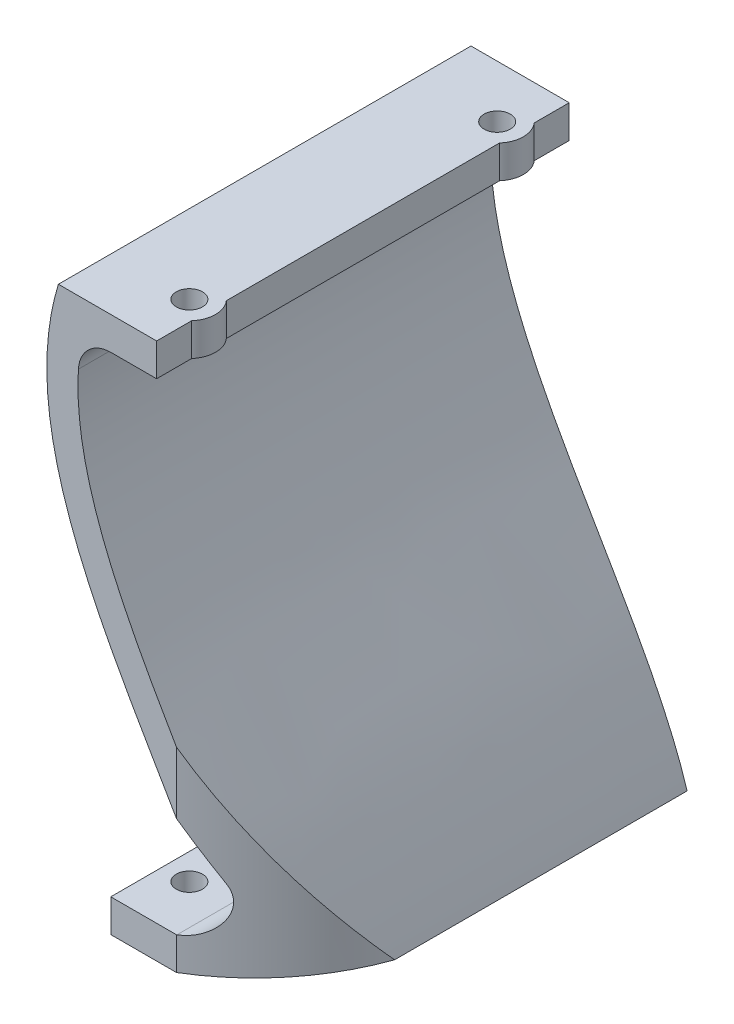
ISO-10303-21;
HEADER;
FILE_DESCRIPTION(('STEP AP214'),'2;1');
FILE_NAME('part.step','',(''),(''),'','','');
FILE_SCHEMA(('AUTOMOTIVE_DESIGN { 1 0 10303 214 1 1 1 1 }'));
ENDSEC;
DATA;
#1=APPLICATION_CONTEXT('core data for automotive mechanical design processes');
#2=APPLICATION_PROTOCOL_DEFINITION('international standard','automotive_design',2000,#1);
#3=PRODUCT_CONTEXT('',#1,'mechanical');
#4=PRODUCT('Part','Part','',(#3));
#5=PRODUCT_RELATED_PRODUCT_CATEGORY('part','',(#4));
#6=PRODUCT_DEFINITION_FORMATION('','',#4);
#7=PRODUCT_DEFINITION_CONTEXT('part definition',#1,'design');
#8=PRODUCT_DEFINITION('design','',#6,#7);
#9=PRODUCT_DEFINITION_SHAPE('','',#8);
#10=(LENGTH_UNIT() NAMED_UNIT(*) SI_UNIT(.MILLI.,.METRE.));
#11=(NAMED_UNIT(*) PLANE_ANGLE_UNIT() SI_UNIT($,.RADIAN.));
#12=(NAMED_UNIT(*) SI_UNIT($,.STERADIAN.) SOLID_ANGLE_UNIT());
#13=UNCERTAINTY_MEASURE_WITH_UNIT(LENGTH_MEASURE(1.E-05),#10,'distance_accuracy_value','');
#14=(GEOMETRIC_REPRESENTATION_CONTEXT(3) GLOBAL_UNCERTAINTY_ASSIGNED_CONTEXT((#13)) GLOBAL_UNIT_ASSIGNED_CONTEXT((#10,
#11,#12)) REPRESENTATION_CONTEXT('',''));
#15=CARTESIAN_POINT('',(0.,0.,0.));
#16=DIRECTION('',(0.,0.,1.));
#17=DIRECTION('',(1.,0.,0.));
#18=AXIS2_PLACEMENT_3D('',#15,#16,#17);
#19=CARTESIAN_POINT('',(-8.04588699669594,16.1895240178556,63.));
#20=DIRECTION('',(1.,0.,0.));
#21=DIRECTION('',(0.,0.,-1.));
#22=AXIS2_PLACEMENT_3D('',#19,#20,#21);
#23=PLANE('',#22);
#24=DIRECTION('',(0.,-1.,0.));
#25=VECTOR('',#24,1.);
#26=CARTESIAN_POINT('',(-8.04588699669594,21.1895240178556,10.6457513110646));
#27=LINE('',#26,#25);
#28=CARTESIAN_POINT('',(-8.04588699669594,21.1895240178556,10.6457513110646));
#29=VERTEX_POINT('',#28);
#30=CARTESIAN_POINT('',(-8.04588699669594,16.1895240178556,10.6457513110646));
#31=VERTEX_POINT('',#30);
#32=EDGE_CURVE('E55',#29,#31,#27,.T.);
#33=ORIENTED_EDGE('',*,*,#32,.F.);
#34=DIRECTION('',(0.,0.,-1.));
#35=VECTOR('',#34,1.);
#36=CARTESIAN_POINT('',(-8.04588699669594,21.1895240178556,63.));
#37=LINE('',#36,#35);
#38=CARTESIAN_POINT('',(-8.04588699669594,21.1895240178556,52.3542486889354));
#39=VERTEX_POINT('',#38);
#40=EDGE_CURVE('E201',#39,#29,#37,.T.);
#41=ORIENTED_EDGE('',*,*,#40,.F.);
#42=DIRECTION('',(0.,-1.,0.));
#43=VECTOR('',#42,1.);
#44=CARTESIAN_POINT('',(-8.04588699669594,21.1895240178556,52.3542486889354));
#45=LINE('',#44,#43);
#46=CARTESIAN_POINT('',(-8.04588699669594,16.1895240178556,52.3542486889354));
#47=VERTEX_POINT('',#46);
#48=EDGE_CURVE('E178',#47,#39,#45,.F.);
#49=ORIENTED_EDGE('',*,*,#48,.F.);
#50=DIRECTION('',(0.,0.,-1.));
#51=VECTOR('',#50,1.);
#52=CARTESIAN_POINT('',(-8.04588699669594,16.1895240178556,63.));
#53=LINE('',#52,#51);
#54=EDGE_CURVE('E153',#47,#31,#53,.T.);
#55=ORIENTED_EDGE('',*,*,#54,.T.);
#56=EDGE_LOOP('',(#33,#41,#49,#55));
#57=FACE_BOUND('',#56,.T.);
#58=ADVANCED_FACE('F32',(#57),#23,.T.);
#59=DIRECTION('',(0.,-1.,0.));
#60=VECTOR('',#59,1.);
#61=CARTESIAN_POINT('',(-8.04588699669594,21.1895240178556,57.6457513110646));
#62=LINE('',#61,#60);
#63=CARTESIAN_POINT('',(-8.04588699669594,21.1895240178556,57.6457513110646));
#64=VERTEX_POINT('',#63);
#65=CARTESIAN_POINT('',(-8.04588699669594,16.1895240178556,57.6457513110646));
#66=VERTEX_POINT('',#65);
#67=EDGE_CURVE('E183',#64,#66,#62,.T.);
#68=ORIENTED_EDGE('',*,*,#67,.F.);
#69=CARTESIAN_POINT('',(-8.04588699669594,21.1895240178556,63.));
#70=VERTEX_POINT('',#69);
#71=EDGE_CURVE('E154',#70,#64,#37,.T.);
#72=ORIENTED_EDGE('',*,*,#71,.F.);
#73=DIRECTION('',(0.,1.,0.));
#74=VECTOR('',#73,1.);
#75=CARTESIAN_POINT('',(-8.04588699669594,16.1895240178556,63.));
#76=LINE('',#75,#74);
#77=CARTESIAN_POINT('',(-8.04588699669594,16.1895240178556,63.));
#78=VERTEX_POINT('',#77);
#79=EDGE_CURVE('E198',#78,#70,#76,.T.);
#80=ORIENTED_EDGE('',*,*,#79,.F.);
#81=EDGE_CURVE('E156',#78,#66,#53,.T.);
#82=ORIENTED_EDGE('',*,*,#81,.T.);
#83=EDGE_LOOP('',(#68,#72,#80,#82));
#84=FACE_BOUND('',#83,.T.);
#85=ADVANCED_FACE('F390',(#84),#23,.T.);
#86=CARTESIAN_POINT('',(-22.5334776197952,22.7570781612548,63.));
#87=CARTESIAN_POINT('',(-22.8802638174594,21.7643013859488,63.));
#88=CARTESIAN_POINT('',(-23.5022218297949,19.7353540922829,63.));
#89=CARTESIAN_POINT('',(-24.3984566732412,15.7227335791878,63.));
#90=CARTESIAN_POINT('',(-24.9259424602794,10.7154717202631,63.));
#91=CARTESIAN_POINT('',(-24.7059244457818,4.80639957244901,63.));
#92=CARTESIAN_POINT('',(-23.4437954980132,-2.90791828688786,63.));
#93=CARTESIAN_POINT('',(-20.3649701079,-12.2138739410152,63.));
#94=CARTESIAN_POINT('',(-15.1627192062184,-22.9267758821705,63.));
#95=CARTESIAN_POINT('',(-9.22446854976525,-33.2839412268649,63.));
#96=CARTESIAN_POINT('',(-4.2731817504284,-41.6523064711653,63.));
#97=CARTESIAN_POINT('',(-0.670405229165687,-48.1782991582584,63.));
#98=CARTESIAN_POINT('',(1.76514247549924,-52.980809675903,63.));
#99=CARTESIAN_POINT('',(3.49961876568494,-56.8892897902748,63.));
#100=CARTESIAN_POINT('',(4.67496429136453,-59.9655632013083,63.));
#101=CARTESIAN_POINT('',(5.17847746688474,-61.4613851443489,63.));
#102=CARTESIAN_POINT('',(5.41540171981831,-62.2227851308582,63.));
#103=B_SPLINE_CURVE_WITH_KNOTS('',3,(#86,#87,#88,#89,#90,#91,#92,#93,#94,#95,#96,#97,#98,#99,
#100,#101,#102),.UNSPECIFIED.,.F.,.F.,(4,1,1,1,1,1,1,1,1,1,1,1,1,1,4),(0.,0.03125,0.0625,0.125,
0.1875,0.25,0.375,0.5,0.625,0.75,0.8125,0.875,0.9375,0.96875,1.),.UNSPECIFIED.);
#104=DIRECTION('',(0.,0.,-1.));
#105=VECTOR('',#104,1.);
#106=SURFACE_OF_LINEAR_EXTRUSION('',#103,#105);
#107=CARTESIAN_POINT('',(-22.5334776197952,22.7570781612548,0.));
#108=CARTESIAN_POINT('',(-22.8802638174594,21.7643013859488,0.));
#109=CARTESIAN_POINT('',(-23.5022218297949,19.7353540922829,0.));
#110=CARTESIAN_POINT('',(-24.3984566732412,15.7227335791878,0.));
#111=CARTESIAN_POINT('',(-24.9259424602794,10.7154717202631,0.));
#112=CARTESIAN_POINT('',(-24.7059244457818,4.80639957244901,0.));
#113=CARTESIAN_POINT('',(-23.4437954980132,-2.90791828688786,0.));
#114=CARTESIAN_POINT('',(-20.3649701079,-12.2138739410152,0.));
#115=CARTESIAN_POINT('',(-15.1627192062184,-22.9267758821705,0.));
#116=CARTESIAN_POINT('',(-9.22446854976525,-33.2839412268649,0.));
#117=CARTESIAN_POINT('',(-4.2731817504284,-41.6523064711653,0.));
#118=CARTESIAN_POINT('',(-0.670405229165687,-48.1782991582584,0.));
#119=CARTESIAN_POINT('',(1.76514247549924,-52.980809675903,0.));
#120=CARTESIAN_POINT('',(3.49961876568494,-56.8892897902748,0.));
#121=CARTESIAN_POINT('',(4.67496429136453,-59.9655632013083,0.));
#122=CARTESIAN_POINT('',(5.17847746688474,-61.4613851443489,0.));
#123=CARTESIAN_POINT('',(5.41540171981831,-62.2227851308582,0.));
#124=B_SPLINE_CURVE_WITH_KNOTS('',3,(#107,#108,#109,#110,#111,#112,#113,#114,#115,#116,#117,
#118,#119,#120,#121,#122,#123),.UNSPECIFIED.,.F.,.F.,(4,1,1,1,1,1,1,1,1,1,1,1,1,1,4),(0.,
0.03125,0.0625,0.125,0.1875,0.25,0.375,0.5,0.625,0.75,0.8125,0.875,0.9375,0.96875,1.),.UNSPECIFIED.);
#125=CARTESIAN_POINT('',(-23.0458869966959,21.1895240178556,0.));
#126=VERTEX_POINT('',#125);
#127=CARTESIAN_POINT('',(-0.547367076397604,-48.4799277852592,0.));
#128=VERTEX_POINT('',#127);
#129=EDGE_CURVE('E321',#126,#128,#124,.T.);
#130=ORIENTED_EDGE('',*,*,#129,.T.);
#131=DIRECTION('',(0.,0.,-1.));
#132=VECTOR('',#131,1.);
#133=CARTESIAN_POINT('',(-0.547367076397604,-48.4799277852592,0.));
#134=LINE('',#133,#132);
#135=CARTESIAN_POINT('',(-0.547367076397604,-48.4799277852592,59.8107553305762));
#136=VERTEX_POINT('',#135);
#137=EDGE_CURVE('E345',#128,#136,#134,.F.);
#138=ORIENTED_EDGE('',*,*,#137,.T.);
#139=CARTESIAN_POINT('',(4.95411300330391,-60.8104759821441,54.0000000000008));
#140=CARTESIAN_POINT('',(4.90349240523971,-60.6624313935854,54.0674948355469));
#141=CARTESIAN_POINT('',(4.85228015714574,-60.5147179013902,54.1352686678515));
#142=CARTESIAN_POINT('',(4.74872079575584,-60.2199020777657,54.2712735017647));
#143=CARTESIAN_POINT('',(4.69637369264215,-60.0727997408671,54.3395044992676));
#144=CARTESIAN_POINT('',(4.53770600661707,-59.6323418051575,54.5447278378918));
#145=CARTESIAN_POINT('',(4.42975460412531,-59.3398223214441,54.6822564553985));
#146=CARTESIAN_POINT('',(4.2099997972146,-58.7573547873543,54.9578604064212));
#147=CARTESIAN_POINT('',(4.09820516931407,-58.4674025618739,55.0959339299031));
#148=CARTESIAN_POINT('',(3.87072927247109,-57.8892159839013,55.372479618315));
#149=CARTESIAN_POINT('',(3.75504796123735,-57.6009816501418,55.5109517875676));
#150=CARTESIAN_POINT('',(3.40277730186655,-56.7393967928728,55.9259585911872));
#151=CARTESIAN_POINT('',(3.16063667503191,-56.1683081741342,56.2024916641073));
#152=CARTESIAN_POINT('',(2.66323588313109,-55.0311603375767,56.752440378181));
#153=CARTESIAN_POINT('',(2.40798853220512,-54.4650968189405,57.0258587564976));
#154=CARTESIAN_POINT('',(1.88556069418228,-53.3365016649056,57.567548245747));
#155=CARTESIAN_POINT('',(1.61838726458699,-52.7739681595952,57.8358222700236));
#156=CARTESIAN_POINT('',(1.073194276384,-51.6511984601395,58.3656141915534));
#157=CARTESIAN_POINT('',(0.79517759037044,-51.0909617004231,58.6271338480642));
#158=CARTESIAN_POINT('',(0.229354253579259,-49.971891846354,59.1421014589343));
#159=CARTESIAN_POINT('',(-0.0584503905774647,-49.4130584892179,59.3955510473469));
#160=CARTESIAN_POINT('',(-0.643021472242761,-48.2958111208271,59.8934766461389));
#161=CARTESIAN_POINT('',(-0.939790828653196,-47.7373973081717,60.1379496750854));
#162=CARTESIAN_POINT('',(-1.54143204723711,-46.620198752619,60.6171398718671));
#163=CARTESIAN_POINT('',(-1.84630918952724,-46.0614140111213,60.8518504136079));
#164=CARTESIAN_POINT('',(-2.46331872475682,-44.9427496650343,61.3108798373551));
#165=CARTESIAN_POINT('',(-2.77545814129195,-44.3828695246849,61.5351879732312));
#166=CARTESIAN_POINT('',(-3.40618824346694,-43.2613700453329,61.9729133196452));
#167=CARTESIAN_POINT('',(-3.72478710707736,-42.6997493772916,62.1863153414548));
#168=CARTESIAN_POINT('',(-4.36760769727572,-41.5741550070399,62.6018397814107));
#169=CARTESIAN_POINT('',(-4.6918380749877,-41.0101789264886,62.803942373091));
#170=CARTESIAN_POINT('',(-5.01813061937269,-40.4452947255246,63.));
#171=B_SPLINE_CURVE_WITH_KNOTS('',3,(#139,#140,#141,#142,#143,#144,#145,#146,#147,#148,#149,
#150,#151,#152,#153,#154,#155,#156,#157,#158,#159,#160,#161,#162,#163,#164,#165,#166,#167,#168,
#169,#170),.UNSPECIFIED.,.F.,.F.,(4,2,2,2,2,2,2,2,2,2,2,2,2,2,2,4),(0.,0.51118765682345,
1.0223707290117,2.04469209211411,3.0648164806874,4.08495197290759,6.12221617166067,
8.15752516266589,10.1916452842124,12.2252301392514,14.2584005745832,16.2922402994086,
18.3274386472271,20.3646946291989,22.4047145812519,24.4482084138024),.UNSPECIFIED.);
#172=CARTESIAN_POINT('',(-5.01813061937269,-40.4452947344386,63.));
#173=VERTEX_POINT('',#172);
#174=EDGE_CURVE('E234',#136,#173,#171,.T.);
#175=ORIENTED_EDGE('',*,*,#174,.T.);
#176=CARTESIAN_POINT('',(-23.0458869966959,21.1895240178556,63.));
#177=VERTEX_POINT('',#176);
#178=EDGE_CURVE('E303',#177,#173,#103,.T.);
#179=ORIENTED_EDGE('',*,*,#178,.F.);
#180=DIRECTION('',(0.,0.,-1.));
#181=VECTOR('',#180,1.);
#182=CARTESIAN_POINT('',(-23.0458869966959,21.1895240178556,63.));
#183=LINE('',#182,#181);
#184=EDGE_CURVE('E333',#177,#126,#183,.T.);
#185=ORIENTED_EDGE('',*,*,#184,.T.);
#186=EDGE_LOOP('',(#130,#138,#175,#179,#185));
#187=FACE_BOUND('',#186,.T.);
#188=ADVANCED_FACE('F250',(#187),#106,.F.);
#189=CARTESIAN_POINT('',(9.95411300330407,-60.8104759821444,63.));
#190=CARTESIAN_POINT('',(1.78782004145555,-34.5665002552168,63.));
#191=CARTESIAN_POINT('',(-27.9913048539535,-7.28206006884536,63.));
#192=CARTESIAN_POINT('',(-18.0458869966959,21.1895240178556,63.));
#193=B_SPLINE_CURVE_WITH_KNOTS('',3,(#189,#190,#191,#192),.UNSPECIFIED.,.F.,.F.,(4,4),(0.,1.),.UNSPECIFIED.);
#194=DIRECTION('',(0.,0.,-1.));
#195=VECTOR('',#194,1.);
#196=SURFACE_OF_LINEAR_EXTRUSION('',#193,#195);
#197=CARTESIAN_POINT('',(9.95411300330407,-60.8104759821444,0.));
#198=CARTESIAN_POINT('',(1.78782004145555,-34.5665002552168,0.));
#199=CARTESIAN_POINT('',(-27.9913048539535,-7.28206006884536,0.));
#200=CARTESIAN_POINT('',(-18.0458869966959,21.1895240178556,0.));
#201=B_SPLINE_CURVE_WITH_KNOTS('',3,(#197,#198,#199,#200),.UNSPECIFIED.,.F.,.F.,(4,4),(0.,1.),.UNSPECIFIED.);
#202=CARTESIAN_POINT('',(9.95411300330406,-60.8104759821444,0.));
#203=VERTEX_POINT('',#202);
#204=CARTESIAN_POINT('',(-19.9900394366485,11.486126685123,0.));
#205=VERTEX_POINT('',#204);
#206=EDGE_CURVE('E280',#203,#205,#201,.T.);
#207=ORIENTED_EDGE('',*,*,#206,.T.);
#208=DIRECTION('',(0.,0.,-1.));
#209=VECTOR('',#208,1.);
#210=CARTESIAN_POINT('',(-19.9900394366485,11.486126685123,0.));
#211=LINE('',#210,#209);
#212=CARTESIAN_POINT('',(-19.9900394366485,11.486126685123,63.));
#213=VERTEX_POINT('',#212);
#214=EDGE_CURVE('E277',#205,#213,#211,.F.);
#215=ORIENTED_EDGE('',*,*,#214,.T.);
#216=CARTESIAN_POINT('',(-5.01813061937411,-31.0078311625551,63.));
#217=VERTEX_POINT('',#216);
#218=EDGE_CURVE('E292',#217,#213,#193,.T.);
#219=ORIENTED_EDGE('',*,*,#218,.F.);
#220=CARTESIAN_POINT('',(-5.0181306193727,-31.0078311625575,63.));
#221=CARTESIAN_POINT('',(-4.60935478871972,-31.7093489817674,62.7543834576857));
#222=CARTESIAN_POINT('',(-4.20131738668795,-32.4074621662793,62.4977858251789));
#223=CARTESIAN_POINT('',(-3.38815053326057,-33.7979902999724,61.9622212423446));
#224=CARTESIAN_POINT('',(-2.98302506777499,-34.4903975790361,61.6832283301339));
#225=CARTESIAN_POINT('',(-2.17774614790639,-35.8695543054951,61.1027999865766));
#226=CARTESIAN_POINT('',(-1.77759715288152,-36.5562985153545,60.8013459119863));
#227=CARTESIAN_POINT('',(-0.984236379295756,-37.9241689025045,60.176069993751));
#228=CARTESIAN_POINT('',(-0.591028520440266,-38.6052917966567,59.8522359892382));
#229=CARTESIAN_POINT('',(0.186556274459307,-39.9619679869169,59.1823796789401));
#230=CARTESIAN_POINT('',(0.570930531293133,-40.6375195544411,58.8363507590432));
#231=CARTESIAN_POINT('',(1.3290305770706,-41.9831065709882,58.1223910025535));
#232=CARTESIAN_POINT('',(1.70275537964647,-42.6531415049921,57.7544581468735));
#233=CARTESIAN_POINT('',(2.43012663076156,-43.9738009345563,57.0049927504614));
#234=CARTESIAN_POINT('',(2.78402981414216,-44.6245377583915,56.6239074134592));
#235=CARTESIAN_POINT('',(3.47834929596888,-45.9207760458694,55.841592183967));
#236=CARTESIAN_POINT('',(3.8187694469618,-46.5662789624713,55.4403681211582));
#237=CARTESIAN_POINT('',(4.48461305361077,-47.8521060489027,54.6183080963177));
#238=CARTESIAN_POINT('',(4.81004218024758,-48.4924321002493,54.1974796736569));
#239=CARTESIAN_POINT('',(5.44446074986746,-49.7679759540932,53.3368082931973));
#240=CARTESIAN_POINT('',(5.75345713100086,-50.4031958147794,52.8969735046521));
#241=CARTESIAN_POINT('',(6.35362692502806,-51.668602208051,51.998950726406));
#242=CARTESIAN_POINT('',(6.64480781639683,-52.2987907547047,51.5407705731015));
#243=CARTESIAN_POINT('',(7.20802833998733,-53.5542360752454,50.6067565075788));
#244=CARTESIAN_POINT('',(7.48007509549706,-54.1794946066895,50.1309292668871));
#245=CARTESIAN_POINT('',(7.88360437077701,-55.1393628105839,49.3846055812668));
#246=CARTESIAN_POINT('',(8.02228760728581,-55.4756419508452,49.1201168128509));
#247=CARTESIAN_POINT('',(8.29348824945376,-56.1468062732093,48.5863134766866));
#248=CARTESIAN_POINT('',(8.42600620315316,-56.4816915767931,48.3169993408307));
#249=CARTESIAN_POINT('',(8.68468158126303,-57.1500766823737,47.7736773751326));
#250=CARTESIAN_POINT('',(8.81083932781482,-57.4835765537551,47.4996697839553));
#251=CARTESIAN_POINT('',(9.05731909261769,-58.1511351652741,46.9454888321691));
#252=CARTESIAN_POINT('',(9.17760304580604,-58.4851859397498,46.6652889384022));
#253=CARTESIAN_POINT('',(9.41135731410957,-59.1519111697765,46.1004093247949));
#254=CARTESIAN_POINT('',(9.52482730060768,-59.4845855582292,45.8157293897299));
#255=CARTESIAN_POINT('',(9.7447698306712,-60.1485677299589,45.2420271879806));
#256=CARTESIAN_POINT('',(9.85124160344067,-60.4798753589445,44.9530044472646));
#257=CARTESIAN_POINT('',(9.95411300330407,-60.8104759821444,44.6619037896883));
#258=B_SPLINE_CURVE_WITH_KNOTS('',3,(#220,#221,#222,#223,#224,#225,#226,#227,#228,#229,#230,
#231,#232,#233,#234,#235,#236,#237,#238,#239,#240,#241,#242,#243,#244,#245,#246,#247,#248,#249,
#250,#251,#252,#253,#254,#255,#256,#257),.UNSPECIFIED.,.F.,.F.,(4,2,2,2,2,2,2,2,2,2,2,2,2,2,2,2,
2,2,4),(0.,2.5447278282158,5.09244947623089,7.64230986377158,10.1935668641723,12.7455877066058,
15.2978441576055,17.796560169186,20.2945569873373,22.7916009405601,25.2875820950726,
27.7825082102457,30.276500539272,31.625677636978,32.9747345744782,34.3237231141295,
35.6805309618773,37.0374041919111,38.394426620853),.UNSPECIFIED.);
#259=CARTESIAN_POINT('',(9.95411300330406,-60.8104759821444,44.6619037896883));
#260=VERTEX_POINT('',#259);
#261=EDGE_CURVE('E242',#217,#260,#258,.T.);
#262=ORIENTED_EDGE('',*,*,#261,.T.);
#263=DIRECTION('',(0.,0.,-1.));
#264=VECTOR('',#263,1.);
#265=CARTESIAN_POINT('',(9.95411300330406,-60.8104759821444,63.));
#266=LINE('',#265,#264);
#267=EDGE_CURVE('E308',#260,#203,#266,.T.);
#268=ORIENTED_EDGE('',*,*,#267,.T.);
#269=EDGE_LOOP('',(#207,#215,#219,#262,#268));
#270=FACE_BOUND('',#269,.T.);
#271=ADVANCED_FACE('F287',(#270),#196,.F.);
#272=CARTESIAN_POINT('',(-18.0458869966959,21.1895240178556,63.));
#273=DIRECTION('',(0.,-1.,0.));
#274=DIRECTION('',(0.,0.,-1.));
#275=AXIS2_PLACEMENT_3D('',#272,#273,#274);
#276=PLANE('',#275);
#277=ORIENTED_EDGE('',*,*,#40,.T.);
#278=CARTESIAN_POINT('',(-11.0458869966959,21.1895240178556,8.));
#279=DIRECTION('',(0.,-1.,0.));
#280=DIRECTION('',(1.,0.,0.));
#281=AXIS2_PLACEMENT_3D('',#278,#279,#280);
#282=CIRCLE('',#281,4.);
#283=CARTESIAN_POINT('',(-8.04588699669594,21.1895240178556,5.35424868893539));
#284=VERTEX_POINT('',#283);
#285=EDGE_CURVE('E162',#284,#29,#282,.T.);
#286=ORIENTED_EDGE('',*,*,#285,.F.);
#287=CARTESIAN_POINT('',(-8.04588699669594,21.1895240178556,0.));
#288=VERTEX_POINT('',#287);
#289=EDGE_CURVE('E47',#284,#288,#37,.T.);
#290=ORIENTED_EDGE('',*,*,#289,.T.);
#291=DIRECTION('',(-1.,0.,0.));
#292=VECTOR('',#291,1.);
#293=CARTESIAN_POINT('',(-18.0458869966959,21.1895240178556,0.));
#294=LINE('',#293,#292);
#295=EDGE_CURVE('E316',#288,#126,#294,.T.);
#296=ORIENTED_EDGE('',*,*,#295,.T.);
#297=ORIENTED_EDGE('',*,*,#184,.F.);
#298=DIRECTION('',(-1.,0.,0.));
#299=VECTOR('',#298,1.);
#300=CARTESIAN_POINT('',(-18.0458869966959,21.1895240178556,63.));
#301=LINE('',#300,#299);
#302=EDGE_CURVE('E298',#70,#177,#301,.T.);
#303=ORIENTED_EDGE('',*,*,#302,.F.);
#304=ORIENTED_EDGE('',*,*,#71,.T.);
#305=CARTESIAN_POINT('',(-11.0458869966959,21.1895240178556,55.));
#306=DIRECTION('',(0.,-1.,0.));
#307=DIRECTION('',(1.,0.,0.));
#308=AXIS2_PLACEMENT_3D('',#305,#306,#307);
#309=CIRCLE('',#308,4.);
#310=EDGE_CURVE('E175',#39,#64,#309,.T.);
#311=ORIENTED_EDGE('',*,*,#310,.F.);
#312=EDGE_LOOP('',(#277,#286,#290,#296,#297,#303,#304,#311));
#313=FACE_BOUND('',#312,.T.);
#314=CARTESIAN_POINT('',(-11.0458869966959,21.1895240178556,55.));
#315=DIRECTION('',(0.,-1.,0.));
#316=DIRECTION('',(0.,0.,-1.));
#317=AXIS2_PLACEMENT_3D('',#314,#315,#316);
#318=CIRCLE('',#317,2.);
#319=CARTESIAN_POINT('',(-11.0458869966959,21.1895240178556,53.));
#320=VERTEX_POINT('',#319);
#321=EDGE_CURVE('E190',#320,#320,#318,.T.);
#322=ORIENTED_EDGE('',*,*,#321,.T.);
#323=EDGE_LOOP('',(#322));
#324=FACE_BOUND('',#323,.T.);
#325=CARTESIAN_POINT('',(-11.0458869966959,21.1895240178556,8.));
#326=DIRECTION('',(0.,-1.,0.));
#327=DIRECTION('',(0.,0.,-1.));
#328=AXIS2_PLACEMENT_3D('',#325,#326,#327);
#329=CIRCLE('',#328,2.);
#330=CARTESIAN_POINT('',(-11.0458869966959,21.1895240178556,6.));
#331=VERTEX_POINT('',#330);
#332=EDGE_CURVE('E195',#331,#331,#329,.T.);
#333=ORIENTED_EDGE('',*,*,#332,.T.);
#334=EDGE_LOOP('',(#333));
#335=FACE_BOUND('',#334,.T.);
#336=ADVANCED_FACE('F290',(#313,#324,#335),#276,.F.);
#337=CARTESIAN_POINT('',(9.95411300330406,-60.8104759821444,63.));
#338=DIRECTION('',(0.,1.,0.));
#339=DIRECTION('',(0.,0.,1.));
#340=AXIS2_PLACEMENT_3D('',#337,#338,#339);
#341=PLANE('',#340);
#342=CARTESIAN_POINT('',(-11.0458869966959,-60.8104759821444,55.));
#343=DIRECTION('',(0.,1.,0.));
#344=DIRECTION('',(0.,0.,1.));
#345=AXIS2_PLACEMENT_3D('',#342,#343,#344);
#346=CIRCLE('',#345,2.);
#347=CARTESIAN_POINT('',(-11.0458869966959,-60.8104759821444,57.));
#348=VERTEX_POINT('',#347);
#349=EDGE_CURVE('E165',#348,#348,#346,.T.);
#350=ORIENTED_EDGE('',*,*,#349,.T.);
#351=EDGE_LOOP('',(#350));
#352=FACE_BOUND('',#351,.T.);
#353=CARTESIAN_POINT('',(-11.0458869966959,-60.8104759821444,8.));
#354=DIRECTION('',(0.,1.,0.));
#355=DIRECTION('',(0.,0.,1.));
#356=AXIS2_PLACEMENT_3D('',#353,#354,#355);
#357=CIRCLE('',#356,2.);
#358=CARTESIAN_POINT('',(-11.0458869966959,-60.8104759821444,10.));
#359=VERTEX_POINT('',#358);
#360=EDGE_CURVE('E571',#359,#359,#357,.T.);
#361=ORIENTED_EDGE('',*,*,#360,.T.);
#362=EDGE_LOOP('',(#361));
#363=FACE_BOUND('',#362,.T.);
#364=ORIENTED_EDGE('',*,*,#267,.F.);
#365=CARTESIAN_POINT('',(-23.0458869966979,-60.8104759821444,33.0000000000031));
#366=DIRECTION('',(0.,1.,0.));
#367=DIRECTION('',(0.,0.,-1.));
#368=AXIS2_PLACEMENT_3D('',#365,#366,#367);
#369=CIRCLE('',#368,35.);
#370=CARTESIAN_POINT('',(-5.01813061937269,-60.8104759821444,63.));
#371=VERTEX_POINT('',#370);
#372=EDGE_CURVE('E229',#371,#260,#369,.T.);
#373=ORIENTED_EDGE('',*,*,#372,.F.);
#374=DIRECTION('',(-1.,0.,0.));
#375=VECTOR('',#374,1.);
#376=CARTESIAN_POINT('',(-5.01813061937269,-60.8104759821444,63.));
#377=LINE('',#376,#375);
#378=CARTESIAN_POINT('',(-15.0458869966959,-60.8104759821444,63.));
#379=VERTEX_POINT('',#378);
#380=EDGE_CURVE('E221',#371,#379,#377,.T.);
#381=ORIENTED_EDGE('',*,*,#380,.T.);
#382=DIRECTION('',(0.,0.,-1.));
#383=VECTOR('',#382,1.);
#384=CARTESIAN_POINT('',(-15.0458869966959,-60.8104759821444,0.));
#385=LINE('',#384,#383);
#386=CARTESIAN_POINT('',(-15.0458869966959,-60.8104759821444,0.));
#387=VERTEX_POINT('',#386);
#388=EDGE_CURVE('E211',#379,#387,#385,.T.);
#389=ORIENTED_EDGE('',*,*,#388,.T.);
#390=DIRECTION('',(1.,0.,0.));
#391=VECTOR('',#390,1.);
#392=CARTESIAN_POINT('',(9.95411300330406,-60.8104759821444,0.));
#393=LINE('',#392,#391);
#394=EDGE_CURVE('E299',#387,#203,#393,.T.);
#395=ORIENTED_EDGE('',*,*,#394,.T.);
#396=EDGE_LOOP('',(#364,#373,#381,#389,#395));
#397=FACE_BOUND('',#396,.T.);
#398=ADVANCED_FACE('F373',(#352,#363,#397),#341,.F.);
#399=CARTESIAN_POINT('',(-10.8377785538607,-20.6458291170594,63.));
#400=DIRECTION('',(0.,0.,-1.));
#401=DIRECTION('',(-1.,0.,0.));
#402=AXIS2_PLACEMENT_3D('',#399,#400,#401);
#403=PLANE('',#402);
#404=ORIENTED_EDGE('',*,*,#178,.T.);
#405=DIRECTION('',(0.,-1.,0.));
#406=VECTOR('',#405,1.);
#407=CARTESIAN_POINT('',(-5.0181306193727,-0.81047598214444,63.));
#408=LINE('',#407,#406);
#409=EDGE_CURVE('E337',#173,#217,#408,.F.);
#410=ORIENTED_EDGE('',*,*,#409,.T.);
#411=ORIENTED_EDGE('',*,*,#218,.T.);
#412=CARTESIAN_POINT('',(-14.9988445037922,11.1895240178556,63.));
#413=DIRECTION('',(0.,0.,-1.));
#414=DIRECTION('',(-1.,0.,0.));
#415=AXIS2_PLACEMENT_3D('',#412,#413,#414);
#416=CIRCLE('',#415,5.);
#417=CARTESIAN_POINT('',(-14.9988445037922,16.1895240178556,63.));
#418=VERTEX_POINT('',#417);
#419=EDGE_CURVE('E40',#213,#418,#416,.T.);
#420=ORIENTED_EDGE('',*,*,#419,.T.);
#421=DIRECTION('',(1.,0.,0.));
#422=VECTOR('',#421,1.);
#423=CARTESIAN_POINT('',(-18.0458869966959,16.1895240178556,63.));
#424=LINE('',#423,#422);
#425=EDGE_CURVE('E204',#418,#78,#424,.T.);
#426=ORIENTED_EDGE('',*,*,#425,.T.);
#427=ORIENTED_EDGE('',*,*,#79,.T.);
#428=ORIENTED_EDGE('',*,*,#302,.T.);
#429=EDGE_LOOP('',(#404,#410,#411,#420,#426,#427,#428));
#430=FACE_BOUND('',#429,.T.);
#431=ADVANCED_FACE('F265',(#430),#403,.F.);
#432=CARTESIAN_POINT('',(-10.8377785538607,-20.6458291170594,0.));
#433=DIRECTION('',(0.,0.,-1.));
#434=DIRECTION('',(-1.,0.,0.));
#435=AXIS2_PLACEMENT_3D('',#432,#433,#434);
#436=PLANE('',#435);
#437=ORIENTED_EDGE('',*,*,#394,.F.);
#438=DIRECTION('',(0.,-1.,0.));
#439=VECTOR('',#438,1.);
#440=CARTESIAN_POINT('',(-15.0458869966959,-55.8104759821444,0.));
#441=LINE('',#440,#439);
#442=CARTESIAN_POINT('',(-15.0458869966959,-55.8104759821444,0.));
#443=VERTEX_POINT('',#442);
#444=EDGE_CURVE('E226',#443,#387,#441,.T.);
#445=ORIENTED_EDGE('',*,*,#444,.F.);
#446=DIRECTION('',(1.,0.,0.));
#447=VECTOR('',#446,1.);
#448=CARTESIAN_POINT('',(-15.0458869966959,-55.8104759821444,0.));
#449=LINE('',#448,#447);
#450=CARTESIAN_POINT('',(-4.97100190558444,-55.8104759821444,0.));
#451=VERTEX_POINT('',#450);
#452=EDGE_CURVE('E217',#443,#451,#449,.T.);
#453=ORIENTED_EDGE('',*,*,#452,.T.);
#454=CARTESIAN_POINT('',(-4.97100190558444,-50.8104759821445,0.));
#455=DIRECTION('',(0.,0.,-1.));
#456=DIRECTION('',(-1.,0.,0.));
#457=AXIS2_PLACEMENT_3D('',#454,#455,#456);
#458=CIRCLE('',#457,5.);
#459=EDGE_CURVE('E278',#451,#128,#458,.F.);
#460=ORIENTED_EDGE('',*,*,#459,.T.);
#461=ORIENTED_EDGE('',*,*,#129,.F.);
#462=ORIENTED_EDGE('',*,*,#295,.F.);
#463=DIRECTION('',(0.,1.,0.));
#464=VECTOR('',#463,1.);
#465=CARTESIAN_POINT('',(-8.04588699669594,16.1895240178556,0.));
#466=LINE('',#465,#464);
#467=CARTESIAN_POINT('',(-8.04588699669594,16.1895240178556,0.));
#468=VERTEX_POINT('',#467);
#469=EDGE_CURVE('E202',#468,#288,#466,.T.);
#470=ORIENTED_EDGE('',*,*,#469,.F.);
#471=DIRECTION('',(1.,0.,0.));
#472=VECTOR('',#471,1.);
#473=CARTESIAN_POINT('',(-18.0458869966959,16.1895240178556,0.));
#474=LINE('',#473,#472);
#475=CARTESIAN_POINT('',(-14.9988445037922,16.1895240178556,0.));
#476=VERTEX_POINT('',#475);
#477=EDGE_CURVE('E151',#476,#468,#474,.T.);
#478=ORIENTED_EDGE('',*,*,#477,.F.);
#479=CARTESIAN_POINT('',(-14.9988445037922,11.1895240178556,0.));
#480=DIRECTION('',(0.,0.,-1.));
#481=DIRECTION('',(-1.,0.,0.));
#482=AXIS2_PLACEMENT_3D('',#479,#480,#481);
#483=CIRCLE('',#482,5.);
#484=EDGE_CURVE('E11',#476,#205,#483,.F.);
#485=ORIENTED_EDGE('',*,*,#484,.T.);
#486=ORIENTED_EDGE('',*,*,#206,.F.);
#487=EDGE_LOOP('',(#437,#445,#453,#460,#461,#462,#470,#478,#485,#486));
#488=FACE_BOUND('',#487,.T.);
#489=ADVANCED_FACE('F261',(#488),#436,.T.);
#490=CARTESIAN_POINT('',(-23.0458869966979,-0.81047598214444,33.0000000000031));
#491=DIRECTION('',(0.,-1.,0.));
#492=DIRECTION('',(0.,0.,-1.));
#493=AXIS2_PLACEMENT_3D('',#490,#491,#492);
#494=CYLINDRICAL_SURFACE('',#493,35.);
#495=ORIENTED_EDGE('',*,*,#174,.F.);
#496=CARTESIAN_POINT('',(-0.547367076397604,-48.4799277852592,59.8107553305762));
#497=CARTESIAN_POINT('',(-0.497352203450341,-48.5748468475239,59.7687849611889));
#498=CARTESIAN_POINT('',(-0.450019764998988,-48.6721128439989,59.7288266569617));
#499=CARTESIAN_POINT('',(-0.361168492256912,-48.8710692269845,59.6534602501073));
#500=CARTESIAN_POINT('',(-0.319654517811251,-48.9727632201404,59.6180559531997));
#501=CARTESIAN_POINT('',(-0.242818447225023,-49.1805668908898,59.5522623449912));
#502=CARTESIAN_POINT('',(-0.207522084906531,-49.2866927706424,59.5218939054326));
#503=CARTESIAN_POINT('',(-0.14382381436109,-49.5024257205868,59.4669090416992));
#504=CARTESIAN_POINT('',(-0.115420130789087,-49.6120318861198,59.4422911364225));
#505=CARTESIAN_POINT('',(-0.0658086346219534,-49.8346912834593,59.3991872392885));
#506=CARTESIAN_POINT('',(-0.0446400195729425,-49.9477597854684,59.3807346611385));
#507=CARTESIAN_POINT('',(-0.0100835349486135,-50.1759650327343,59.3505652176071));
#508=CARTESIAN_POINT('',(0.00330495077993898,-50.2911016134632,59.3388478188289));
#509=CARTESIAN_POINT('',(0.0220263081494884,-50.5222417277358,59.3224529924965));
#510=CARTESIAN_POINT('',(0.0273790214721301,-50.6382424127962,59.3177582249814));
#511=CARTESIAN_POINT('',(0.0299864462437955,-50.8703973771393,59.3154720293513));
#512=CARTESIAN_POINT('',(0.0272417972542282,-50.9865516435673,59.3178800402309));
#513=CARTESIAN_POINT('',(0.014212274575819,-51.2094162834473,59.3292971767019));
#514=CARTESIAN_POINT('',(0.00450321260185671,-51.3161866951164,59.3378021772774));
#515=CARTESIAN_POINT('',(-0.0216385549246912,-51.5282790162719,59.3606576974807));
#516=CARTESIAN_POINT('',(-0.0380734494454068,-51.6336004426306,59.3750101201851));
#517=CARTESIAN_POINT('',(-0.0971422077593378,-51.9464481650583,59.4264624477316));
#518=CARTESIAN_POINT('',(-0.14954077910925,-52.1508681925408,59.4719579771349));
#519=CARTESIAN_POINT('',(-0.279391107321395,-52.5525353358603,59.5837189177769));
#520=CARTESIAN_POINT('',(-0.357542116475636,-52.7493878720789,59.6505622103834));
#521=CARTESIAN_POINT('',(-0.53490076550024,-53.1266136831699,59.8005413058401));
#522=CARTESIAN_POINT('',(-0.634117139343329,-53.3069800781656,59.8836838654777));
#523=CARTESIAN_POINT('',(-0.901248947470861,-53.7303818198436,60.104561923925));
#524=CARTESIAN_POINT('',(-1.07954931100205,-53.963086436961,60.2496026421771));
#525=CARTESIAN_POINT('',(-1.46653422765664,-54.3884200521527,60.5570834783933));
#526=CARTESIAN_POINT('',(-1.67527583877909,-54.5809721055028,60.7195561155713));
#527=CARTESIAN_POINT('',(-2.12012880916492,-54.927903181211,61.0569367494142));
#528=CARTESIAN_POINT('',(-2.35660260492555,-55.0816686616995,61.2319943104723));
#529=CARTESIAN_POINT('',(-2.84899729626945,-55.3464666206391,61.586319357166));
#530=CARTESIAN_POINT('',(-3.10490289376471,-55.4575323061428,61.7655834558403));
#531=CARTESIAN_POINT('',(-3.62427851514264,-55.6332581712266,62.1186665332604));
#532=CARTESIAN_POINT('',(-3.88731818345797,-55.6991631406167,62.2924935897343));
#533=CARTESIAN_POINT('',(-4.28905794886377,-55.7656153777095,62.5500728983311));
#534=CARTESIAN_POINT('',(-4.42421349722153,-55.782365426749,62.6354333114313));
#535=CARTESIAN_POINT('',(-4.69636862489995,-55.8047927567,62.8047128158873));
#536=CARTESIAN_POINT('',(-4.83336856804437,-55.8104678197646,62.8886316152151));
#537=CARTESIAN_POINT('',(-4.97100190558442,-55.8104759821445,62.9716287335746));
#538=B_SPLINE_CURVE_WITH_KNOTS('',3,(#496,#497,#498,#499,#500,#501,#502,#503,#504,#505,#506,
#507,#508,#509,#510,#511,#512,#513,#514,#515,#516,#517,#518,#519,#520,#521,#522,#523,#524,#525,
#526,#527,#528,#529,#530,#531,#532,#533,#534,#535,#536,#537),.UNSPECIFIED.,.F.,.F.,(4,2,2,2,2,2,
2,2,2,2,2,2,2,2,2,2,2,2,2,2,4),(0.,0.345602334729504,0.691491633555237,1.03878050083468,
1.38597982186137,1.7350314115602,2.0840553540853,2.43221607178991,2.78034929113282,
3.1025977631233,3.4249511965914,4.06962747740181,4.73349157817641,5.39763146498129,
6.37355759369337,7.35133705244375,8.3437302896735,9.33535018737793,10.2984006856782,
10.7802426315688,11.2621810599296),.UNSPECIFIED.);
#539=CARTESIAN_POINT('',(-4.97100190558443,-55.8104759821444,62.9716287335746));
#540=VERTEX_POINT('',#539);
#541=EDGE_CURVE('E270',#136,#540,#538,.T.);
#542=ORIENTED_EDGE('',*,*,#541,.T.);
#543=CARTESIAN_POINT('',(-23.0458869966979,-55.8104759821444,33.0000000000031));
#544=DIRECTION('',(0.,-1.,0.));
#545=DIRECTION('',(0.,0.,-1.));
#546=AXIS2_PLACEMENT_3D('',#543,#544,#545);
#547=CIRCLE('',#546,35.);
#548=CARTESIAN_POINT('',(-5.01813061937269,-55.8104759821444,63.));
#549=VERTEX_POINT('',#548);
#550=EDGE_CURVE('E208',#540,#549,#547,.T.);
#551=ORIENTED_EDGE('',*,*,#550,.T.);
#552=DIRECTION('',(0.,-1.,0.));
#553=VECTOR('',#552,1.);
#554=CARTESIAN_POINT('',(-5.01813061937269,-55.8104759821444,63.));
#555=LINE('',#554,#553);
#556=EDGE_CURVE('E220',#549,#371,#555,.T.);
#557=ORIENTED_EDGE('',*,*,#556,.T.);
#558=ORIENTED_EDGE('',*,*,#372,.T.);
#559=ORIENTED_EDGE('',*,*,#261,.F.);
#560=ORIENTED_EDGE('',*,*,#409,.F.);
#561=EDGE_LOOP('',(#495,#542,#551,#557,#558,#559,#560));
#562=FACE_BOUND('',#561,.T.);
#563=ADVANCED_FACE('F255',(#562),#494,.T.);
#564=CARTESIAN_POINT('',(-23.0458869966979,-55.8104759821444,33.0000000000031));
#565=DIRECTION('',(0.,-1.,0.));
#566=DIRECTION('',(0.,0.,-1.));
#567=AXIS2_PLACEMENT_3D('',#564,#565,#566);
#568=PLANE('',#567);
#569=CARTESIAN_POINT('',(-11.0458869966959,-55.8104759821444,55.));
#570=DIRECTION('',(0.,1.,0.));
#571=DIRECTION('',(0.,0.,1.));
#572=AXIS2_PLACEMENT_3D('',#569,#570,#571);
#573=CIRCLE('',#572,2.);
#574=CARTESIAN_POINT('',(-11.0458869966959,-55.8104759821444,57.));
#575=VERTEX_POINT('',#574);
#576=EDGE_CURVE('E169',#575,#575,#573,.T.);
#577=ORIENTED_EDGE('',*,*,#576,.F.);
#578=EDGE_LOOP('',(#577));
#579=FACE_BOUND('',#578,.T.);
#580=CARTESIAN_POINT('',(-11.0458869966959,-55.8104759821444,8.));
#581=DIRECTION('',(0.,1.,0.));
#582=DIRECTION('',(0.,0.,1.));
#583=AXIS2_PLACEMENT_3D('',#580,#581,#582);
#584=CIRCLE('',#583,2.);
#585=CARTESIAN_POINT('',(-11.0458869966959,-55.8104759821444,10.));
#586=VERTEX_POINT('',#585);
#587=EDGE_CURVE('E574',#586,#586,#584,.T.);
#588=ORIENTED_EDGE('',*,*,#587,.F.);
#589=EDGE_LOOP('',(#588));
#590=FACE_BOUND('',#589,.T.);
#591=ORIENTED_EDGE('',*,*,#550,.F.);
#592=DIRECTION('',(0.,0.,1.));
#593=VECTOR('',#592,1.);
#594=CARTESIAN_POINT('',(-4.97100190558444,-55.8104759821444,0.));
#595=LINE('',#594,#593);
#596=EDGE_CURVE('E343',#540,#451,#595,.F.);
#597=ORIENTED_EDGE('',*,*,#596,.T.);
#598=ORIENTED_EDGE('',*,*,#452,.F.);
#599=DIRECTION('',(0.,0.,-1.));
#600=VECTOR('',#599,1.);
#601=CARTESIAN_POINT('',(-15.0458869966959,-55.8104759821444,0.));
#602=LINE('',#601,#600);
#603=CARTESIAN_POINT('',(-15.0458869966959,-55.8104759821444,63.));
#604=VERTEX_POINT('',#603);
#605=EDGE_CURVE('E214',#604,#443,#602,.T.);
#606=ORIENTED_EDGE('',*,*,#605,.F.);
#607=DIRECTION('',(-1.,0.,0.));
#608=VECTOR('',#607,1.);
#609=CARTESIAN_POINT('',(-5.01813061937269,-55.8104759821444,63.));
#610=LINE('',#609,#608);
#611=EDGE_CURVE('E210',#549,#604,#610,.T.);
#612=ORIENTED_EDGE('',*,*,#611,.F.);
#613=EDGE_LOOP('',(#591,#597,#598,#606,#612));
#614=FACE_BOUND('',#613,.T.);
#615=ADVANCED_FACE('F260',(#579,#590,#614),#568,.F.);
#616=CARTESIAN_POINT('',(-15.0458869966959,-55.8104759821444,0.));
#617=DIRECTION('',(-1.,0.,0.));
#618=DIRECTION('',(0.,0.,1.));
#619=AXIS2_PLACEMENT_3D('',#616,#617,#618);
#620=PLANE('',#619);
#621=ORIENTED_EDGE('',*,*,#388,.F.);
#622=DIRECTION('',(0.,-1.,0.));
#623=VECTOR('',#622,1.);
#624=CARTESIAN_POINT('',(-15.0458869966959,-55.8104759821444,63.));
#625=LINE('',#624,#623);
#626=EDGE_CURVE('E230',#604,#379,#625,.T.);
#627=ORIENTED_EDGE('',*,*,#626,.F.);
#628=ORIENTED_EDGE('',*,*,#605,.T.);
#629=ORIENTED_EDGE('',*,*,#444,.T.);
#630=EDGE_LOOP('',(#621,#627,#628,#629));
#631=FACE_BOUND('',#630,.T.);
#632=ADVANCED_FACE('F415',(#631),#620,.T.);
#633=CARTESIAN_POINT('',(-5.01813061937269,-55.8104759821444,63.));
#634=DIRECTION('',(0.,0.,1.));
#635=DIRECTION('',(1.,0.,0.));
#636=AXIS2_PLACEMENT_3D('',#633,#634,#635);
#637=PLANE('',#636);
#638=ORIENTED_EDGE('',*,*,#380,.F.);
#639=ORIENTED_EDGE('',*,*,#556,.F.);
#640=ORIENTED_EDGE('',*,*,#611,.T.);
#641=ORIENTED_EDGE('',*,*,#626,.T.);
#642=EDGE_LOOP('',(#638,#639,#640,#641));
#643=FACE_BOUND('',#642,.T.);
#644=ADVANCED_FACE('F263',(#643),#637,.T.);
#645=CARTESIAN_POINT('',(-4.97100190558444,-50.8104759821445,28.1877687802507));
#646=DIRECTION('',(0.,0.,-1.));
#647=DIRECTION('',(-1.,0.,0.));
#648=AXIS2_PLACEMENT_3D('',#645,#646,#647);
#649=CYLINDRICAL_SURFACE('',#648,5.);
#650=ORIENTED_EDGE('',*,*,#541,.F.);
#651=ORIENTED_EDGE('',*,*,#137,.F.);
#652=ORIENTED_EDGE('',*,*,#459,.F.);
#653=ORIENTED_EDGE('',*,*,#596,.F.);
#654=EDGE_LOOP('',(#650,#651,#652,#653));
#655=FACE_BOUND('',#654,.T.);
#656=ADVANCED_FACE('F283',(#655),#649,.F.);
#657=CARTESIAN_POINT('',(-18.0458869966959,16.1895240178556,-5.17978739319327));
#658=DIRECTION('',(0.,-1.,0.));
#659=DIRECTION('',(1.,0.,0.));
#660=AXIS2_PLACEMENT_3D('',#657,#658,#659);
#661=PLANE('',#660);
#662=CARTESIAN_POINT('',(-8.04588699669594,16.1895240178556,5.35424868893541));
#663=VERTEX_POINT('',#662);
#664=EDGE_CURVE('E145',#663,#468,#53,.T.);
#665=ORIENTED_EDGE('',*,*,#664,.F.);
#666=CARTESIAN_POINT('',(-11.0458869966959,16.1895240178556,8.));
#667=DIRECTION('',(0.,-1.,0.));
#668=DIRECTION('',(1.,0.,0.));
#669=AXIS2_PLACEMENT_3D('',#666,#667,#668);
#670=CIRCLE('',#669,4.);
#671=EDGE_CURVE('E149',#663,#31,#670,.T.);
#672=ORIENTED_EDGE('',*,*,#671,.T.);
#673=ORIENTED_EDGE('',*,*,#54,.F.);
#674=CARTESIAN_POINT('',(-11.0458869966959,16.1895240178556,55.));
#675=DIRECTION('',(0.,-1.,0.));
#676=DIRECTION('',(1.,0.,0.));
#677=AXIS2_PLACEMENT_3D('',#674,#675,#676);
#678=CIRCLE('',#677,4.);
#679=EDGE_CURVE('E174',#47,#66,#678,.T.);
#680=ORIENTED_EDGE('',*,*,#679,.T.);
#681=ORIENTED_EDGE('',*,*,#81,.F.);
#682=ORIENTED_EDGE('',*,*,#425,.F.);
#683=DIRECTION('',(0.,0.,-1.));
#684=VECTOR('',#683,1.);
#685=CARTESIAN_POINT('',(-14.9988445037922,16.1895240178556,-5.17978739319327));
#686=LINE('',#685,#684);
#687=EDGE_CURVE('E379',#418,#476,#686,.T.);
#688=ORIENTED_EDGE('',*,*,#687,.T.);
#689=ORIENTED_EDGE('',*,*,#477,.T.);
#690=EDGE_LOOP('',(#665,#672,#673,#680,#681,#682,#688,#689));
#691=FACE_BOUND('',#690,.T.);
#692=CARTESIAN_POINT('',(-11.0458869966959,16.1895240178556,8.));
#693=DIRECTION('',(0.,-1.,0.));
#694=DIRECTION('',(1.,0.,0.));
#695=AXIS2_PLACEMENT_3D('',#692,#693,#694);
#696=CIRCLE('',#695,2.);
#697=CARTESIAN_POINT('',(-9.04588699669594,16.1895240178556,8.));
#698=VERTEX_POINT('',#697);
#699=EDGE_CURVE('E187',#698,#698,#696,.T.);
#700=ORIENTED_EDGE('',*,*,#699,.F.);
#701=EDGE_LOOP('',(#700));
#702=FACE_BOUND('',#701,.T.);
#703=CARTESIAN_POINT('',(-11.0458869966959,16.1895240178556,55.));
#704=DIRECTION('',(0.,-1.,0.));
#705=DIRECTION('',(1.,0.,0.));
#706=AXIS2_PLACEMENT_3D('',#703,#704,#705);
#707=CIRCLE('',#706,2.);
#708=CARTESIAN_POINT('',(-9.04588699669594,16.1895240178556,55.));
#709=VERTEX_POINT('',#708);
#710=EDGE_CURVE('E186',#709,#709,#707,.T.);
#711=ORIENTED_EDGE('',*,*,#710,.F.);
#712=EDGE_LOOP('',(#711));
#713=FACE_BOUND('',#712,.T.);
#714=ADVANCED_FACE('F146',(#691,#702,#713),#661,.T.);
#715=DIRECTION('',(0.,-1.,0.));
#716=VECTOR('',#715,1.);
#717=CARTESIAN_POINT('',(-8.04588699669594,21.1895240178556,5.35424868893539));
#718=LINE('',#717,#716);
#719=EDGE_CURVE('E157',#663,#284,#718,.F.);
#720=ORIENTED_EDGE('',*,*,#719,.F.);
#721=ORIENTED_EDGE('',*,*,#664,.T.);
#722=ORIENTED_EDGE('',*,*,#469,.T.);
#723=ORIENTED_EDGE('',*,*,#289,.F.);
#724=EDGE_LOOP('',(#720,#721,#722,#723));
#725=FACE_BOUND('',#724,.T.);
#726=ADVANCED_FACE('F158',(#725),#23,.T.);
#727=CARTESIAN_POINT('',(-14.9988445037922,11.1895240178556,31.5));
#728=DIRECTION('',(0.,0.,-1.));
#729=DIRECTION('',(-1.,0.,0.));
#730=AXIS2_PLACEMENT_3D('',#727,#728,#729);
#731=CYLINDRICAL_SURFACE('',#730,5.);
#732=ORIENTED_EDGE('',*,*,#484,.F.);
#733=ORIENTED_EDGE('',*,*,#687,.F.);
#734=ORIENTED_EDGE('',*,*,#419,.F.);
#735=ORIENTED_EDGE('',*,*,#214,.F.);
#736=EDGE_LOOP('',(#732,#733,#734,#735));
#737=FACE_BOUND('',#736,.T.);
#738=ADVANCED_FACE('F34',(#737),#731,.F.);
#739=CARTESIAN_POINT('',(-11.0458869966959,26.1895240178556,55.));
#740=DIRECTION('',(0.,-1.,0.));
#741=DIRECTION('',(1.,0.,0.));
#742=AXIS2_PLACEMENT_3D('',#739,#740,#741);
#743=CYLINDRICAL_SURFACE('',#742,2.);
#744=ORIENTED_EDGE('',*,*,#710,.T.);
#745=EDGE_LOOP('',(#744));
#746=FACE_BOUND('',#745,.T.);
#747=ORIENTED_EDGE('',*,*,#321,.F.);
#748=EDGE_LOOP('',(#747));
#749=FACE_BOUND('',#748,.T.);
#750=ADVANCED_FACE('F410',(#746,#749),#743,.F.);
#751=CARTESIAN_POINT('',(-11.0458869966959,26.1895240178556,8.));
#752=DIRECTION('',(0.,-1.,0.));
#753=DIRECTION('',(1.,0.,0.));
#754=AXIS2_PLACEMENT_3D('',#751,#752,#753);
#755=CYLINDRICAL_SURFACE('',#754,2.);
#756=ORIENTED_EDGE('',*,*,#699,.T.);
#757=EDGE_LOOP('',(#756));
#758=FACE_BOUND('',#757,.T.);
#759=ORIENTED_EDGE('',*,*,#332,.F.);
#760=EDGE_LOOP('',(#759));
#761=FACE_BOUND('',#760,.T.);
#762=ADVANCED_FACE('F469',(#758,#761),#755,.F.);
#763=CARTESIAN_POINT('',(-11.0458869966959,21.1895240178556,55.));
#764=DIRECTION('',(0.,-1.,0.));
#765=DIRECTION('',(1.,0.,0.));
#766=AXIS2_PLACEMENT_3D('',#763,#764,#765);
#767=CYLINDRICAL_SURFACE('',#766,4.);
#768=ORIENTED_EDGE('',*,*,#310,.T.);
#769=ORIENTED_EDGE('',*,*,#67,.T.);
#770=ORIENTED_EDGE('',*,*,#679,.F.);
#771=ORIENTED_EDGE('',*,*,#48,.T.);
#772=EDGE_LOOP('',(#768,#769,#770,#771));
#773=FACE_BOUND('',#772,.T.);
#774=ADVANCED_FACE('F393',(#773),#767,.T.);
#775=CARTESIAN_POINT('',(-11.0458869966959,21.1895240178556,8.));
#776=DIRECTION('',(0.,-1.,0.));
#777=DIRECTION('',(1.,0.,0.));
#778=AXIS2_PLACEMENT_3D('',#775,#776,#777);
#779=CYLINDRICAL_SURFACE('',#778,4.);
#780=ORIENTED_EDGE('',*,*,#285,.T.);
#781=ORIENTED_EDGE('',*,*,#32,.T.);
#782=ORIENTED_EDGE('',*,*,#671,.F.);
#783=ORIENTED_EDGE('',*,*,#719,.T.);
#784=EDGE_LOOP('',(#780,#781,#782,#783));
#785=FACE_BOUND('',#784,.T.);
#786=ADVANCED_FACE('F164',(#785),#779,.T.);
#787=CARTESIAN_POINT('',(-11.0458869966959,-60.8104759821444,8.));
#788=DIRECTION('',(0.,1.,0.));
#789=DIRECTION('',(0.,0.,1.));
#790=AXIS2_PLACEMENT_3D('',#787,#788,#789);
#791=CYLINDRICAL_SURFACE('',#790,2.);
#792=ORIENTED_EDGE('',*,*,#360,.F.);
#793=EDGE_LOOP('',(#792));
#794=FACE_BOUND('',#793,.T.);
#795=ORIENTED_EDGE('',*,*,#587,.T.);
#796=EDGE_LOOP('',(#795));
#797=FACE_BOUND('',#796,.T.);
#798=ADVANCED_FACE('F527',(#794,#797),#791,.F.);
#799=CARTESIAN_POINT('',(-11.0458869966959,-60.8104759821444,55.));
#800=DIRECTION('',(0.,1.,0.));
#801=DIRECTION('',(0.,0.,1.));
#802=AXIS2_PLACEMENT_3D('',#799,#800,#801);
#803=CYLINDRICAL_SURFACE('',#802,2.);
#804=ORIENTED_EDGE('',*,*,#349,.F.);
#805=EDGE_LOOP('',(#804));
#806=FACE_BOUND('',#805,.T.);
#807=ORIENTED_EDGE('',*,*,#576,.T.);
#808=EDGE_LOOP('',(#807));
#809=FACE_BOUND('',#808,.T.);
#810=ADVANCED_FACE('F553',(#806,#809),#803,.F.);
#811=CLOSED_SHELL('',(#58,#85,#188,#271,#336,#398,#431,#489,#563,#615,#632,#644,#656,#714,#726,
#738,#750,#762,#774,#786,#798,#810));
#812=MANIFOLD_SOLID_BREP('B2',#811);
#813=ADVANCED_BREP_SHAPE_REPRESENTATION('',(#18,#812),#14);
#814=SHAPE_DEFINITION_REPRESENTATION(#9,#813);
ENDSEC;
END-ISO-10303-21;
